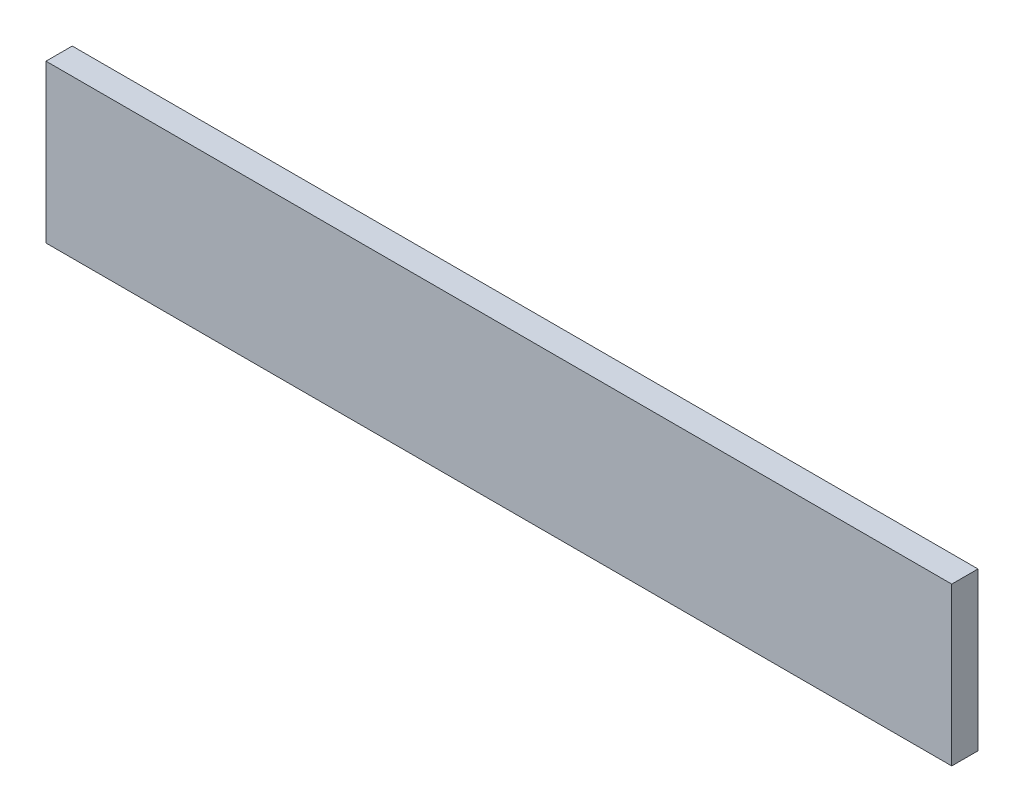
ISO-10303-21;
HEADER;
FILE_DESCRIPTION(('STEP AP214'),'2;1');
FILE_NAME('part.step','',(''),(''),'','','');
FILE_SCHEMA(('AUTOMOTIVE_DESIGN { 1 0 10303 214 1 1 1 1 }'));
ENDSEC;
DATA;
#1=APPLICATION_CONTEXT('core data for automotive mechanical design processes');
#2=APPLICATION_PROTOCOL_DEFINITION('international standard','automotive_design',2000,#1);
#3=PRODUCT_CONTEXT('',#1,'mechanical');
#4=PRODUCT('Part','Part','',(#3));
#5=PRODUCT_RELATED_PRODUCT_CATEGORY('part','',(#4));
#6=PRODUCT_DEFINITION_FORMATION('','',#4);
#7=PRODUCT_DEFINITION_CONTEXT('part definition',#1,'design');
#8=PRODUCT_DEFINITION('design','',#6,#7);
#9=PRODUCT_DEFINITION_SHAPE('','',#8);
#10=(LENGTH_UNIT() NAMED_UNIT(*) SI_UNIT(.MILLI.,.METRE.));
#11=(NAMED_UNIT(*) PLANE_ANGLE_UNIT() SI_UNIT($,.RADIAN.));
#12=(NAMED_UNIT(*) SI_UNIT($,.STERADIAN.) SOLID_ANGLE_UNIT());
#13=UNCERTAINTY_MEASURE_WITH_UNIT(LENGTH_MEASURE(1.E-05),#10,'distance_accuracy_value','');
#14=(GEOMETRIC_REPRESENTATION_CONTEXT(3) GLOBAL_UNCERTAINTY_ASSIGNED_CONTEXT((#13)) GLOBAL_UNIT_ASSIGNED_CONTEXT((#10,
#11,#12)) REPRESENTATION_CONTEXT('',''));
#15=CARTESIAN_POINT('',(0.,0.,0.));
#16=DIRECTION('',(0.,0.,1.));
#17=DIRECTION('',(1.,0.,0.));
#18=AXIS2_PLACEMENT_3D('',#15,#16,#17);
#19=CARTESIAN_POINT('',(0.,0.,20.));
#20=DIRECTION('',(1.,0.,0.));
#21=DIRECTION('',(0.,0.,-1.));
#22=AXIS2_PLACEMENT_3D('',#19,#20,#21);
#23=PLANE('',#22);
#24=DIRECTION('',(0.,-1.,0.));
#25=VECTOR('',#24,1.);
#26=CARTESIAN_POINT('',(0.,0.,0.));
#27=LINE('',#26,#25);
#28=CARTESIAN_POINT('',(0.,120.,0.));
#29=VERTEX_POINT('',#28);
#30=CARTESIAN_POINT('',(0.,0.,0.));
#31=VERTEX_POINT('',#30);
#32=EDGE_CURVE('E105',#29,#31,#27,.T.);
#33=ORIENTED_EDGE('',*,*,#32,.T.);
#34=DIRECTION('',(0.,0.,-1.));
#35=VECTOR('',#34,1.);
#36=CARTESIAN_POINT('',(0.,0.,20.));
#37=LINE('',#36,#35);
#38=CARTESIAN_POINT('',(0.,0.,20.));
#39=VERTEX_POINT('',#38);
#40=EDGE_CURVE('E11',#39,#31,#37,.T.);
#41=ORIENTED_EDGE('',*,*,#40,.F.);
#42=DIRECTION('',(0.,-1.,0.));
#43=VECTOR('',#42,1.);
#44=CARTESIAN_POINT('',(0.,0.,20.));
#45=LINE('',#44,#43);
#46=CARTESIAN_POINT('',(0.,120.,20.));
#47=VERTEX_POINT('',#46);
#48=EDGE_CURVE('E89',#47,#39,#45,.T.);
#49=ORIENTED_EDGE('',*,*,#48,.F.);
#50=DIRECTION('',(0.,0.,-1.));
#51=VECTOR('',#50,1.);
#52=CARTESIAN_POINT('',(0.,120.,20.));
#53=LINE('',#52,#51);
#54=EDGE_CURVE('E98',#47,#29,#53,.T.);
#55=ORIENTED_EDGE('',*,*,#54,.T.);
#56=EDGE_LOOP('',(#33,#41,#49,#55));
#57=FACE_BOUND('',#56,.T.);
#58=ADVANCED_FACE('F39',(#57),#23,.F.);
#59=CARTESIAN_POINT('',(0.,0.,20.));
#60=DIRECTION('',(0.,1.,0.));
#61=DIRECTION('',(0.,0.,1.));
#62=AXIS2_PLACEMENT_3D('',#59,#60,#61);
#63=PLANE('',#62);
#64=DIRECTION('',(1.,0.,0.));
#65=VECTOR('',#64,1.);
#66=CARTESIAN_POINT('',(0.,0.,0.));
#67=LINE('',#66,#65);
#68=CARTESIAN_POINT('',(690.,0.,0.));
#69=VERTEX_POINT('',#68);
#70=EDGE_CURVE('E94',#31,#69,#67,.T.);
#71=ORIENTED_EDGE('',*,*,#70,.T.);
#72=DIRECTION('',(0.,0.,-1.));
#73=VECTOR('',#72,1.);
#74=CARTESIAN_POINT('',(690.,0.,20.));
#75=LINE('',#74,#73);
#76=CARTESIAN_POINT('',(690.,0.,20.));
#77=VERTEX_POINT('',#76);
#78=EDGE_CURVE('E50',#77,#69,#75,.T.);
#79=ORIENTED_EDGE('',*,*,#78,.F.);
#80=DIRECTION('',(1.,0.,0.));
#81=VECTOR('',#80,1.);
#82=CARTESIAN_POINT('',(0.,0.,20.));
#83=LINE('',#82,#81);
#84=EDGE_CURVE('E84',#39,#77,#83,.T.);
#85=ORIENTED_EDGE('',*,*,#84,.F.);
#86=ORIENTED_EDGE('',*,*,#40,.T.);
#87=EDGE_LOOP('',(#71,#79,#85,#86));
#88=FACE_BOUND('',#87,.T.);
#89=ADVANCED_FACE('F91',(#88),#63,.F.);
#90=CARTESIAN_POINT('',(690.,0.,20.));
#91=DIRECTION('',(-1.,0.,0.));
#92=DIRECTION('',(0.,0.,1.));
#93=AXIS2_PLACEMENT_3D('',#90,#91,#92);
#94=PLANE('',#93);
#95=DIRECTION('',(0.,1.,0.));
#96=VECTOR('',#95,1.);
#97=CARTESIAN_POINT('',(690.,0.,0.));
#98=LINE('',#97,#96);
#99=CARTESIAN_POINT('',(690.,120.,0.));
#100=VERTEX_POINT('',#99);
#101=EDGE_CURVE('E75',#69,#100,#98,.T.);
#102=ORIENTED_EDGE('',*,*,#101,.T.);
#103=DIRECTION('',(0.,0.,-1.));
#104=VECTOR('',#103,1.);
#105=CARTESIAN_POINT('',(690.,120.,20.));
#106=LINE('',#105,#104);
#107=CARTESIAN_POINT('',(690.,120.,20.));
#108=VERTEX_POINT('',#107);
#109=EDGE_CURVE('E92',#108,#100,#106,.T.);
#110=ORIENTED_EDGE('',*,*,#109,.F.);
#111=DIRECTION('',(0.,1.,0.));
#112=VECTOR('',#111,1.);
#113=CARTESIAN_POINT('',(690.,0.,20.));
#114=LINE('',#113,#112);
#115=EDGE_CURVE('E86',#77,#108,#114,.T.);
#116=ORIENTED_EDGE('',*,*,#115,.F.);
#117=ORIENTED_EDGE('',*,*,#78,.T.);
#118=EDGE_LOOP('',(#102,#110,#116,#117));
#119=FACE_BOUND('',#118,.T.);
#120=ADVANCED_FACE('F96',(#119),#94,.F.);
#121=CARTESIAN_POINT('',(0.,120.,20.));
#122=DIRECTION('',(0.,-1.,0.));
#123=DIRECTION('',(0.,0.,-1.));
#124=AXIS2_PLACEMENT_3D('',#121,#122,#123);
#125=PLANE('',#124);
#126=DIRECTION('',(-1.,0.,0.));
#127=VECTOR('',#126,1.);
#128=CARTESIAN_POINT('',(0.,120.,0.));
#129=LINE('',#128,#127);
#130=EDGE_CURVE('E79',#100,#29,#129,.T.);
#131=ORIENTED_EDGE('',*,*,#130,.T.);
#132=ORIENTED_EDGE('',*,*,#54,.F.);
#133=DIRECTION('',(-1.,0.,0.));
#134=VECTOR('',#133,1.);
#135=CARTESIAN_POINT('',(0.,120.,20.));
#136=LINE('',#135,#134);
#137=EDGE_CURVE('E54',#108,#47,#136,.T.);
#138=ORIENTED_EDGE('',*,*,#137,.F.);
#139=ORIENTED_EDGE('',*,*,#109,.T.);
#140=EDGE_LOOP('',(#131,#132,#138,#139));
#141=FACE_BOUND('',#140,.T.);
#142=ADVANCED_FACE('F108',(#141),#125,.F.);
#143=CARTESIAN_POINT('',(0.,0.,20.));
#144=DIRECTION('',(0.,0.,-1.));
#145=DIRECTION('',(-1.,0.,0.));
#146=AXIS2_PLACEMENT_3D('',#143,#144,#145);
#147=PLANE('',#146);
#148=ORIENTED_EDGE('',*,*,#48,.T.);
#149=ORIENTED_EDGE('',*,*,#84,.T.);
#150=ORIENTED_EDGE('',*,*,#115,.T.);
#151=ORIENTED_EDGE('',*,*,#137,.T.);
#152=EDGE_LOOP('',(#148,#149,#150,#151));
#153=FACE_BOUND('',#152,.T.);
#154=ADVANCED_FACE('F88',(#153),#147,.F.);
#155=CARTESIAN_POINT('',(0.,0.,0.));
#156=DIRECTION('',(0.,0.,-1.));
#157=DIRECTION('',(-1.,0.,0.));
#158=AXIS2_PLACEMENT_3D('',#155,#156,#157);
#159=PLANE('',#158);
#160=ORIENTED_EDGE('',*,*,#32,.F.);
#161=ORIENTED_EDGE('',*,*,#130,.F.);
#162=ORIENTED_EDGE('',*,*,#101,.F.);
#163=ORIENTED_EDGE('',*,*,#70,.F.);
#164=EDGE_LOOP('',(#160,#161,#162,#163));
#165=FACE_BOUND('',#164,.T.);
#166=ADVANCED_FACE('F115',(#165),#159,.T.);
#167=CLOSED_SHELL('',(#58,#89,#120,#142,#154,#166));
#168=MANIFOLD_SOLID_BREP('B2',#167);
#169=ADVANCED_BREP_SHAPE_REPRESENTATION('',(#18,#168),#14);
#170=SHAPE_DEFINITION_REPRESENTATION(#9,#169);
ENDSEC;
END-ISO-10303-21;
